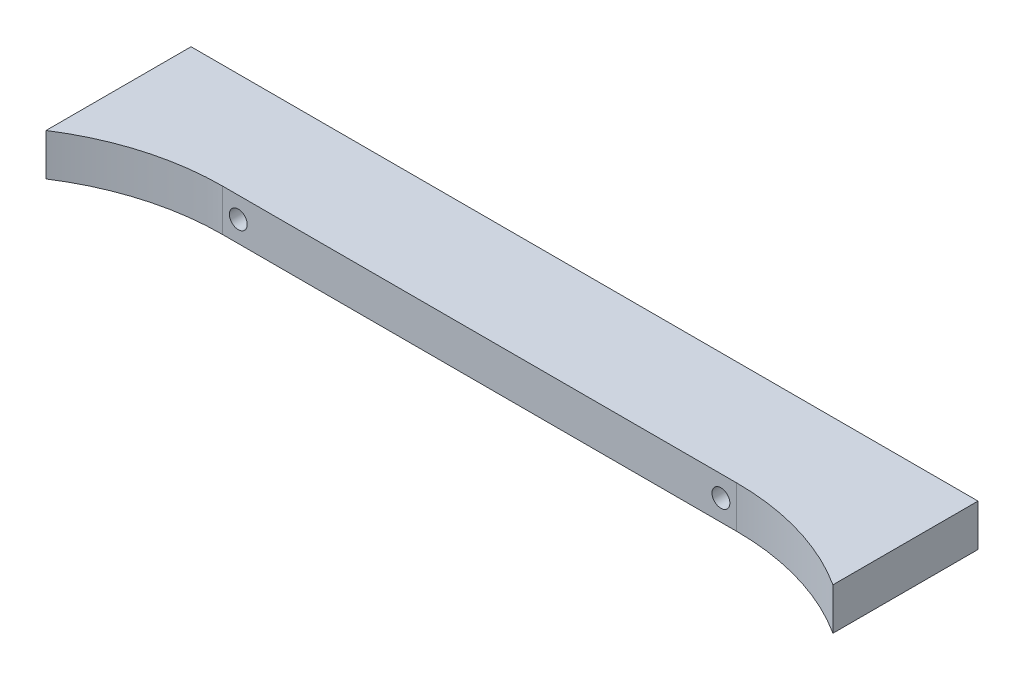
ISO-10303-21;
HEADER;
FILE_DESCRIPTION(('STEP AP214'),'2;1');
FILE_NAME('part.step','',(''),(''),'','','');
FILE_SCHEMA(('AUTOMOTIVE_DESIGN { 1 0 10303 214 1 1 1 1 }'));
ENDSEC;
DATA;
#1=APPLICATION_CONTEXT('core data for automotive mechanical design processes');
#2=APPLICATION_PROTOCOL_DEFINITION('international standard','automotive_design',2000,#1);
#3=PRODUCT_CONTEXT('',#1,'mechanical');
#4=PRODUCT('Part','Part','',(#3));
#5=PRODUCT_RELATED_PRODUCT_CATEGORY('part','',(#4));
#6=PRODUCT_DEFINITION_FORMATION('','',#4);
#7=PRODUCT_DEFINITION_CONTEXT('part definition',#1,'design');
#8=PRODUCT_DEFINITION('design','',#6,#7);
#9=PRODUCT_DEFINITION_SHAPE('','',#8);
#10=(LENGTH_UNIT() NAMED_UNIT(*) SI_UNIT(.MILLI.,.METRE.));
#11=(NAMED_UNIT(*) PLANE_ANGLE_UNIT() SI_UNIT($,.RADIAN.));
#12=(NAMED_UNIT(*) SI_UNIT($,.STERADIAN.) SOLID_ANGLE_UNIT());
#13=UNCERTAINTY_MEASURE_WITH_UNIT(LENGTH_MEASURE(1.E-05),#10,'distance_accuracy_value','');
#14=(GEOMETRIC_REPRESENTATION_CONTEXT(3) GLOBAL_UNCERTAINTY_ASSIGNED_CONTEXT((#13)) GLOBAL_UNIT_ASSIGNED_CONTEXT((#10,
#11,#12)) REPRESENTATION_CONTEXT('',''));
#15=CARTESIAN_POINT('',(0.,0.,0.));
#16=DIRECTION('',(0.,0.,1.));
#17=DIRECTION('',(1.,0.,0.));
#18=AXIS2_PLACEMENT_3D('',#15,#16,#17);
#19=CARTESIAN_POINT('',(0.,8.,10.));
#20=DIRECTION('',(0.,0.,-1.));
#21=DIRECTION('',(-1.,0.,0.));
#22=AXIS2_PLACEMENT_3D('',#19,#20,#21);
#23=PLANE('',#22);
#24=CARTESIAN_POINT('',(46.,4.,10.));
#25=DIRECTION('',(0.,0.,-1.));
#26=DIRECTION('',(-1.,0.,0.));
#27=AXIS2_PLACEMENT_3D('',#24,#25,#26);
#28=CIRCLE('',#27,1.7);
#29=CARTESIAN_POINT('',(44.3,4.,10.));
#30=VERTEX_POINT('',#29);
#31=EDGE_CURVE('E44',#30,#30,#28,.T.);
#32=ORIENTED_EDGE('',*,*,#31,.T.);
#33=EDGE_LOOP('',(#32));
#34=FACE_BOUND('',#33,.T.);
#35=CARTESIAN_POINT('',(-46.,4.,10.));
#36=DIRECTION('',(0.,0.,-1.));
#37=DIRECTION('',(-1.,0.,0.));
#38=AXIS2_PLACEMENT_3D('',#35,#36,#37);
#39=CIRCLE('',#38,1.7);
#40=CARTESIAN_POINT('',(-47.7,4.,10.));
#41=VERTEX_POINT('',#40);
#42=EDGE_CURVE('E130',#41,#41,#39,.T.);
#43=ORIENTED_EDGE('',*,*,#42,.T.);
#44=EDGE_LOOP('',(#43));
#45=FACE_BOUND('',#44,.T.);
#46=DIRECTION('',(1.,0.,0.));
#47=VECTOR('',#46,1.);
#48=CARTESIAN_POINT('',(0.,0.,10.));
#49=LINE('',#48,#47);
#50=CARTESIAN_POINT('',(-49.,0.,10.));
#51=VERTEX_POINT('',#50);
#52=CARTESIAN_POINT('',(49.,0.,10.));
#53=VERTEX_POINT('',#52);
#54=EDGE_CURVE('E127',#51,#53,#49,.T.);
#55=ORIENTED_EDGE('',*,*,#54,.T.);
#56=DIRECTION('',(0.,-1.,0.));
#57=VECTOR('',#56,1.);
#58=CARTESIAN_POINT('',(49.,8.,10.));
#59=LINE('',#58,#57);
#60=CARTESIAN_POINT('',(49.,8.,10.));
#61=VERTEX_POINT('',#60);
#62=EDGE_CURVE('E11',#61,#53,#59,.T.);
#63=ORIENTED_EDGE('',*,*,#62,.F.);
#64=DIRECTION('',(1.,0.,0.));
#65=VECTOR('',#64,1.);
#66=CARTESIAN_POINT('',(0.,8.,10.));
#67=LINE('',#66,#65);
#68=CARTESIAN_POINT('',(-49.,8.,10.));
#69=VERTEX_POINT('',#68);
#70=EDGE_CURVE('E141',#69,#61,#67,.T.);
#71=ORIENTED_EDGE('',*,*,#70,.F.);
#72=DIRECTION('',(0.,-1.,0.));
#73=VECTOR('',#72,1.);
#74=CARTESIAN_POINT('',(-49.,8.,10.));
#75=LINE('',#74,#73);
#76=EDGE_CURVE('E59',#69,#51,#75,.T.);
#77=ORIENTED_EDGE('',*,*,#76,.T.);
#78=EDGE_LOOP('',(#55,#63,#71,#77));
#79=FACE_BOUND('',#78,.T.);
#80=ADVANCED_FACE('F41',(#34,#45,#79),#23,.F.);
#81=CARTESIAN_POINT('',(49.,8.,58.));
#82=DIRECTION('',(0.,-1.,0.));
#83=DIRECTION('',(0.,0.,-1.));
#84=AXIS2_PLACEMENT_3D('',#81,#82,#83);
#85=CYLINDRICAL_SURFACE('',#84,48.);
#86=CARTESIAN_POINT('',(49.,0.,58.));
#87=DIRECTION('',(0.,1.,0.));
#88=DIRECTION('',(0.,0.,1.));
#89=AXIS2_PLACEMENT_3D('',#86,#87,#88);
#90=CIRCLE('',#89,48.);
#91=CARTESIAN_POINT('',(75.,0.,17.651517996336));
#92=VERTEX_POINT('',#91);
#93=EDGE_CURVE('E129',#53,#92,#90,.F.);
#94=ORIENTED_EDGE('',*,*,#93,.T.);
#95=DIRECTION('',(0.,-1.,0.));
#96=VECTOR('',#95,1.);
#97=CARTESIAN_POINT('',(75.,8.,17.651517996336));
#98=LINE('',#97,#96);
#99=CARTESIAN_POINT('',(75.,8.,17.651517996336));
#100=VERTEX_POINT('',#99);
#101=EDGE_CURVE('E50',#100,#92,#98,.T.);
#102=ORIENTED_EDGE('',*,*,#101,.F.);
#103=CARTESIAN_POINT('',(49.,8.,58.));
#104=DIRECTION('',(0.,1.,0.));
#105=DIRECTION('',(0.,0.,1.));
#106=AXIS2_PLACEMENT_3D('',#103,#104,#105);
#107=CIRCLE('',#106,48.);
#108=EDGE_CURVE('E91',#61,#100,#107,.F.);
#109=ORIENTED_EDGE('',*,*,#108,.F.);
#110=ORIENTED_EDGE('',*,*,#62,.T.);
#111=EDGE_LOOP('',(#94,#102,#109,#110));
#112=FACE_BOUND('',#111,.T.);
#113=ADVANCED_FACE('F162',(#112),#85,.F.);
#114=CARTESIAN_POINT('',(75.,8.,0.));
#115=DIRECTION('',(-1.,0.,0.));
#116=DIRECTION('',(0.,0.,1.));
#117=AXIS2_PLACEMENT_3D('',#114,#115,#116);
#118=PLANE('',#117);
#119=DIRECTION('',(0.,0.,-1.));
#120=VECTOR('',#119,1.);
#121=CARTESIAN_POINT('',(75.,0.,0.));
#122=LINE('',#121,#120);
#123=CARTESIAN_POINT('',(75.,0.,-10.));
#124=VERTEX_POINT('',#123);
#125=EDGE_CURVE('E132',#92,#124,#122,.T.);
#126=ORIENTED_EDGE('',*,*,#125,.T.);
#127=DIRECTION('',(0.,-1.,0.));
#128=VECTOR('',#127,1.);
#129=CARTESIAN_POINT('',(75.,8.,-10.));
#130=LINE('',#129,#128);
#131=CARTESIAN_POINT('',(75.,8.,-10.));
#132=VERTEX_POINT('',#131);
#133=EDGE_CURVE('E110',#132,#124,#130,.T.);
#134=ORIENTED_EDGE('',*,*,#133,.F.);
#135=DIRECTION('',(0.,0.,-1.));
#136=VECTOR('',#135,1.);
#137=CARTESIAN_POINT('',(75.,8.,0.));
#138=LINE('',#137,#136);
#139=EDGE_CURVE('E118',#100,#132,#138,.T.);
#140=ORIENTED_EDGE('',*,*,#139,.F.);
#141=ORIENTED_EDGE('',*,*,#101,.T.);
#142=EDGE_LOOP('',(#126,#134,#140,#141));
#143=FACE_BOUND('',#142,.T.);
#144=ADVANCED_FACE('F165',(#143),#118,.F.);
#145=CARTESIAN_POINT('',(0.,8.,-10.));
#146=DIRECTION('',(0.,0.,-1.));
#147=DIRECTION('',(-1.,0.,0.));
#148=AXIS2_PLACEMENT_3D('',#145,#146,#147);
#149=PLANE('',#148);
#150=CARTESIAN_POINT('',(55.,4.,-10.));
#151=DIRECTION('',(0.,0.,-1.));
#152=DIRECTION('',(-1.,0.,0.));
#153=AXIS2_PLACEMENT_3D('',#150,#151,#152);
#154=CIRCLE('',#153,2.6);
#155=CARTESIAN_POINT('',(52.4,4.,-10.));
#156=VERTEX_POINT('',#155);
#157=EDGE_CURVE('E206',#156,#156,#154,.T.);
#158=ORIENTED_EDGE('',*,*,#157,.F.);
#159=EDGE_LOOP('',(#158));
#160=FACE_BOUND('',#159,.T.);
#161=CARTESIAN_POINT('',(-55.,4.00000000000002,-10.));
#162=DIRECTION('',(0.,0.,-1.));
#163=DIRECTION('',(-1.,0.,0.));
#164=AXIS2_PLACEMENT_3D('',#161,#162,#163);
#165=CIRCLE('',#164,2.6);
#166=CARTESIAN_POINT('',(-57.6,4.00000000000002,-10.));
#167=VERTEX_POINT('',#166);
#168=EDGE_CURVE('E200',#167,#167,#165,.T.);
#169=ORIENTED_EDGE('',*,*,#168,.F.);
#170=EDGE_LOOP('',(#169));
#171=FACE_BOUND('',#170,.T.);
#172=CARTESIAN_POINT('',(46.,4.,-10.));
#173=DIRECTION('',(0.,0.,-1.));
#174=DIRECTION('',(-1.,0.,0.));
#175=AXIS2_PLACEMENT_3D('',#172,#173,#174);
#176=CIRCLE('',#175,3.25);
#177=CARTESIAN_POINT('',(42.75,4.,-10.));
#178=VERTEX_POINT('',#177);
#179=EDGE_CURVE('E194',#178,#178,#176,.T.);
#180=ORIENTED_EDGE('',*,*,#179,.F.);
#181=EDGE_LOOP('',(#180));
#182=FACE_BOUND('',#181,.T.);
#183=CARTESIAN_POINT('',(-46.,4.,-10.));
#184=DIRECTION('',(0.,0.,-1.));
#185=DIRECTION('',(-1.,0.,0.));
#186=AXIS2_PLACEMENT_3D('',#183,#184,#185);
#187=CIRCLE('',#186,3.25);
#188=CARTESIAN_POINT('',(-49.25,4.,-10.));
#189=VERTEX_POINT('',#188);
#190=EDGE_CURVE('E156',#189,#189,#187,.T.);
#191=ORIENTED_EDGE('',*,*,#190,.F.);
#192=EDGE_LOOP('',(#191));
#193=FACE_BOUND('',#192,.T.);
#194=DIRECTION('',(1.,0.,0.));
#195=VECTOR('',#194,1.);
#196=CARTESIAN_POINT('',(0.,0.,-10.));
#197=LINE('',#196,#195);
#198=CARTESIAN_POINT('',(-75.,0.,-10.));
#199=VERTEX_POINT('',#198);
#200=EDGE_CURVE('E106',#199,#124,#197,.T.);
#201=ORIENTED_EDGE('',*,*,#200,.F.);
#202=DIRECTION('',(0.,-1.,0.));
#203=VECTOR('',#202,1.);
#204=CARTESIAN_POINT('',(-75.,8.,-10.));
#205=LINE('',#204,#203);
#206=CARTESIAN_POINT('',(-75.,8.,-10.));
#207=VERTEX_POINT('',#206);
#208=EDGE_CURVE('E101',#207,#199,#205,.T.);
#209=ORIENTED_EDGE('',*,*,#208,.F.);
#210=DIRECTION('',(1.,0.,0.));
#211=VECTOR('',#210,1.);
#212=CARTESIAN_POINT('',(0.,8.,-10.));
#213=LINE('',#212,#211);
#214=EDGE_CURVE('E104',#207,#132,#213,.T.);
#215=ORIENTED_EDGE('',*,*,#214,.T.);
#216=ORIENTED_EDGE('',*,*,#133,.T.);
#217=EDGE_LOOP('',(#201,#209,#215,#216));
#218=FACE_BOUND('',#217,.T.);
#219=ADVANCED_FACE('F103',(#160,#171,#182,#193,#218),#149,.T.);
#220=CARTESIAN_POINT('',(-75.,8.,0.));
#221=DIRECTION('',(-1.,0.,0.));
#222=DIRECTION('',(0.,0.,1.));
#223=AXIS2_PLACEMENT_3D('',#220,#221,#222);
#224=PLANE('',#223);
#225=DIRECTION('',(0.,0.,-1.));
#226=VECTOR('',#225,1.);
#227=CARTESIAN_POINT('',(-75.,0.,0.));
#228=LINE('',#227,#226);
#229=CARTESIAN_POINT('',(-75.,0.,17.651517996336));
#230=VERTEX_POINT('',#229);
#231=EDGE_CURVE('E136',#230,#199,#228,.T.);
#232=ORIENTED_EDGE('',*,*,#231,.F.);
#233=DIRECTION('',(0.,-1.,0.));
#234=VECTOR('',#233,1.);
#235=CARTESIAN_POINT('',(-75.,8.,17.651517996336));
#236=LINE('',#235,#234);
#237=CARTESIAN_POINT('',(-75.,8.,17.651517996336));
#238=VERTEX_POINT('',#237);
#239=EDGE_CURVE('E79',#238,#230,#236,.T.);
#240=ORIENTED_EDGE('',*,*,#239,.F.);
#241=DIRECTION('',(0.,0.,-1.));
#242=VECTOR('',#241,1.);
#243=CARTESIAN_POINT('',(-75.,8.,0.));
#244=LINE('',#243,#242);
#245=EDGE_CURVE('E116',#238,#207,#244,.T.);
#246=ORIENTED_EDGE('',*,*,#245,.T.);
#247=ORIENTED_EDGE('',*,*,#208,.T.);
#248=EDGE_LOOP('',(#232,#240,#246,#247));
#249=FACE_BOUND('',#248,.T.);
#250=ADVANCED_FACE('F121',(#249),#224,.T.);
#251=CARTESIAN_POINT('',(-49.,8.,58.));
#252=DIRECTION('',(0.,-1.,0.));
#253=DIRECTION('',(0.,0.,-1.));
#254=AXIS2_PLACEMENT_3D('',#251,#252,#253);
#255=CYLINDRICAL_SURFACE('',#254,48.);
#256=CARTESIAN_POINT('',(-49.,0.,58.));
#257=DIRECTION('',(0.,1.,0.));
#258=DIRECTION('',(0.,0.,1.));
#259=AXIS2_PLACEMENT_3D('',#256,#257,#258);
#260=CIRCLE('',#259,48.);
#261=EDGE_CURVE('E138',#51,#230,#260,.T.);
#262=ORIENTED_EDGE('',*,*,#261,.F.);
#263=ORIENTED_EDGE('',*,*,#76,.F.);
#264=CARTESIAN_POINT('',(-49.,8.,58.));
#265=DIRECTION('',(0.,1.,0.));
#266=DIRECTION('',(0.,0.,1.));
#267=AXIS2_PLACEMENT_3D('',#264,#265,#266);
#268=CIRCLE('',#267,48.);
#269=EDGE_CURVE('E122',#69,#238,#268,.T.);
#270=ORIENTED_EDGE('',*,*,#269,.T.);
#271=ORIENTED_EDGE('',*,*,#239,.T.);
#272=EDGE_LOOP('',(#262,#263,#270,#271));
#273=FACE_BOUND('',#272,.T.);
#274=ADVANCED_FACE('F168',(#273),#255,.F.);
#275=CARTESIAN_POINT('',(0.,8.,0.));
#276=DIRECTION('',(0.,1.,0.));
#277=DIRECTION('',(0.,0.,1.));
#278=AXIS2_PLACEMENT_3D('',#275,#276,#277);
#279=PLANE('',#278);
#280=ORIENTED_EDGE('',*,*,#70,.T.);
#281=ORIENTED_EDGE('',*,*,#108,.T.);
#282=ORIENTED_EDGE('',*,*,#139,.T.);
#283=ORIENTED_EDGE('',*,*,#214,.F.);
#284=ORIENTED_EDGE('',*,*,#245,.F.);
#285=ORIENTED_EDGE('',*,*,#269,.F.);
#286=EDGE_LOOP('',(#280,#281,#282,#283,#284,#285));
#287=FACE_BOUND('',#286,.T.);
#288=ADVANCED_FACE('F114',(#287),#279,.T.);
#289=CARTESIAN_POINT('',(0.,0.,0.));
#290=DIRECTION('',(0.,1.,0.));
#291=DIRECTION('',(0.,0.,1.));
#292=AXIS2_PLACEMENT_3D('',#289,#290,#291);
#293=PLANE('',#292);
#294=ORIENTED_EDGE('',*,*,#54,.F.);
#295=ORIENTED_EDGE('',*,*,#261,.T.);
#296=ORIENTED_EDGE('',*,*,#231,.T.);
#297=ORIENTED_EDGE('',*,*,#200,.T.);
#298=ORIENTED_EDGE('',*,*,#125,.F.);
#299=ORIENTED_EDGE('',*,*,#93,.F.);
#300=EDGE_LOOP('',(#294,#295,#296,#297,#298,#299));
#301=FACE_BOUND('',#300,.T.);
#302=ADVANCED_FACE('F167',(#301),#293,.F.);
#303=CARTESIAN_POINT('',(-46.,4.,-10.));
#304=DIRECTION('',(0.,0.,-1.));
#305=DIRECTION('',(-1.,0.,0.));
#306=AXIS2_PLACEMENT_3D('',#303,#304,#305);
#307=CYLINDRICAL_SURFACE('',#306,1.7);
#308=CARTESIAN_POINT('',(-46.,4.,6.));
#309=DIRECTION('',(0.,0.,-1.));
#310=DIRECTION('',(-1.,0.,0.));
#311=AXIS2_PLACEMENT_3D('',#308,#309,#310);
#312=CIRCLE('',#311,1.7);
#313=CARTESIAN_POINT('',(-47.7,4.,6.));
#314=VERTEX_POINT('',#313);
#315=EDGE_CURVE('E147',#314,#314,#312,.T.);
#316=ORIENTED_EDGE('',*,*,#315,.T.);
#317=EDGE_LOOP('',(#316));
#318=FACE_BOUND('',#317,.T.);
#319=ORIENTED_EDGE('',*,*,#42,.F.);
#320=EDGE_LOOP('',(#319));
#321=FACE_BOUND('',#320,.T.);
#322=ADVANCED_FACE('F242',(#318,#321),#307,.F.);
#323=CARTESIAN_POINT('',(-44.3,4.,6.));
#324=DIRECTION('',(0.,0.,1.));
#325=DIRECTION('',(1.,0.,0.));
#326=AXIS2_PLACEMENT_3D('',#323,#324,#325);
#327=PLANE('',#326);
#328=ORIENTED_EDGE('',*,*,#315,.F.);
#329=EDGE_LOOP('',(#328));
#330=FACE_BOUND('',#329,.T.);
#331=CARTESIAN_POINT('',(-46.,4.,6.));
#332=DIRECTION('',(0.,0.,-1.));
#333=DIRECTION('',(-1.,0.,0.));
#334=AXIS2_PLACEMENT_3D('',#331,#332,#333);
#335=CIRCLE('',#334,3.25);
#336=CARTESIAN_POINT('',(-49.25,4.,6.));
#337=VERTEX_POINT('',#336);
#338=EDGE_CURVE('E151',#337,#337,#335,.T.);
#339=ORIENTED_EDGE('',*,*,#338,.T.);
#340=EDGE_LOOP('',(#339));
#341=FACE_BOUND('',#340,.T.);
#342=ADVANCED_FACE('F233',(#330,#341),#327,.F.);
#343=CARTESIAN_POINT('',(-46.,4.,-10.));
#344=DIRECTION('',(0.,0.,-1.));
#345=DIRECTION('',(-1.,0.,0.));
#346=AXIS2_PLACEMENT_3D('',#343,#344,#345);
#347=CYLINDRICAL_SURFACE('',#346,3.25);
#348=ORIENTED_EDGE('',*,*,#338,.F.);
#349=EDGE_LOOP('',(#348));
#350=FACE_BOUND('',#349,.T.);
#351=ORIENTED_EDGE('',*,*,#190,.T.);
#352=EDGE_LOOP('',(#351));
#353=FACE_BOUND('',#352,.T.);
#354=ADVANCED_FACE('F230',(#350,#353),#347,.F.);
#355=CARTESIAN_POINT('',(46.,4.,-10.));
#356=DIRECTION('',(0.,0.,-1.));
#357=DIRECTION('',(-1.,0.,0.));
#358=AXIS2_PLACEMENT_3D('',#355,#356,#357);
#359=CYLINDRICAL_SURFACE('',#358,1.7);
#360=CARTESIAN_POINT('',(46.,4.,6.));
#361=DIRECTION('',(0.,0.,-1.));
#362=DIRECTION('',(-1.,0.,0.));
#363=AXIS2_PLACEMENT_3D('',#360,#361,#362);
#364=CIRCLE('',#363,1.7);
#365=CARTESIAN_POINT('',(44.3,4.,6.));
#366=VERTEX_POINT('',#365);
#367=EDGE_CURVE('E186',#366,#366,#364,.T.);
#368=ORIENTED_EDGE('',*,*,#367,.T.);
#369=EDGE_LOOP('',(#368));
#370=FACE_BOUND('',#369,.T.);
#371=ORIENTED_EDGE('',*,*,#31,.F.);
#372=EDGE_LOOP('',(#371));
#373=FACE_BOUND('',#372,.T.);
#374=ADVANCED_FACE('F232',(#370,#373),#359,.F.);
#375=CARTESIAN_POINT('',(47.7,4.,6.));
#376=DIRECTION('',(0.,0.,1.));
#377=DIRECTION('',(1.,0.,0.));
#378=AXIS2_PLACEMENT_3D('',#375,#376,#377);
#379=PLANE('',#378);
#380=ORIENTED_EDGE('',*,*,#367,.F.);
#381=EDGE_LOOP('',(#380));
#382=FACE_BOUND('',#381,.T.);
#383=CARTESIAN_POINT('',(46.,4.,6.));
#384=DIRECTION('',(0.,0.,-1.));
#385=DIRECTION('',(-1.,0.,0.));
#386=AXIS2_PLACEMENT_3D('',#383,#384,#385);
#387=CIRCLE('',#386,3.25);
#388=CARTESIAN_POINT('',(42.75,4.,6.));
#389=VERTEX_POINT('',#388);
#390=EDGE_CURVE('E189',#389,#389,#387,.T.);
#391=ORIENTED_EDGE('',*,*,#390,.T.);
#392=EDGE_LOOP('',(#391));
#393=FACE_BOUND('',#392,.T.);
#394=ADVANCED_FACE('F240',(#382,#393),#379,.F.);
#395=CARTESIAN_POINT('',(46.,4.,-10.));
#396=DIRECTION('',(0.,0.,-1.));
#397=DIRECTION('',(-1.,0.,0.));
#398=AXIS2_PLACEMENT_3D('',#395,#396,#397);
#399=CYLINDRICAL_SURFACE('',#398,3.25);
#400=ORIENTED_EDGE('',*,*,#390,.F.);
#401=EDGE_LOOP('',(#400));
#402=FACE_BOUND('',#401,.T.);
#403=ORIENTED_EDGE('',*,*,#179,.T.);
#404=EDGE_LOOP('',(#403));
#405=FACE_BOUND('',#404,.T.);
#406=ADVANCED_FACE('F281',(#402,#405),#399,.F.);
#407=CARTESIAN_POINT('',(-55.,4.00000000000002,0.));
#408=DIRECTION('',(0.,0.,-1.));
#409=DIRECTION('',(-1.,0.,0.));
#410=AXIS2_PLACEMENT_3D('',#407,#408,#409);
#411=CYLINDRICAL_SURFACE('',#410,2.6);
#412=CARTESIAN_POINT('',(-55.,4.00000000000002,0.));
#413=DIRECTION('',(0.,0.,-1.));
#414=DIRECTION('',(-1.,0.,0.));
#415=AXIS2_PLACEMENT_3D('',#412,#413,#414);
#416=CIRCLE('',#415,2.6);
#417=CARTESIAN_POINT('',(-57.6,4.00000000000002,0.));
#418=VERTEX_POINT('',#417);
#419=EDGE_CURVE('E203',#418,#418,#416,.T.);
#420=ORIENTED_EDGE('',*,*,#419,.F.);
#421=EDGE_LOOP('',(#420));
#422=FACE_BOUND('',#421,.T.);
#423=ORIENTED_EDGE('',*,*,#168,.T.);
#424=EDGE_LOOP('',(#423));
#425=FACE_BOUND('',#424,.T.);
#426=ADVANCED_FACE('F290',(#422,#425),#411,.F.);
#427=CARTESIAN_POINT('',(-55.,4.00000000000002,0.));
#428=DIRECTION('',(0.,0.,-1.));
#429=DIRECTION('',(-1.,0.,0.));
#430=AXIS2_PLACEMENT_3D('',#427,#428,#429);
#431=PLANE('',#430);
#432=ORIENTED_EDGE('',*,*,#419,.T.);
#433=EDGE_LOOP('',(#432));
#434=FACE_BOUND('',#433,.T.);
#435=ADVANCED_FACE('F217',(#434),#431,.T.);
#436=CARTESIAN_POINT('',(55.,4.,0.));
#437=DIRECTION('',(0.,0.,-1.));
#438=DIRECTION('',(-1.,0.,0.));
#439=AXIS2_PLACEMENT_3D('',#436,#437,#438);
#440=CYLINDRICAL_SURFACE('',#439,2.6);
#441=CARTESIAN_POINT('',(55.,4.,0.));
#442=DIRECTION('',(0.,0.,-1.));
#443=DIRECTION('',(-1.,0.,0.));
#444=AXIS2_PLACEMENT_3D('',#441,#442,#443);
#445=CIRCLE('',#444,2.6);
#446=CARTESIAN_POINT('',(52.4,4.,0.));
#447=VERTEX_POINT('',#446);
#448=EDGE_CURVE('E199',#447,#447,#445,.T.);
#449=ORIENTED_EDGE('',*,*,#448,.F.);
#450=EDGE_LOOP('',(#449));
#451=FACE_BOUND('',#450,.T.);
#452=ORIENTED_EDGE('',*,*,#157,.T.);
#453=EDGE_LOOP('',(#452));
#454=FACE_BOUND('',#453,.T.);
#455=ADVANCED_FACE('F214',(#451,#454),#440,.F.);
#456=CARTESIAN_POINT('',(55.,4.,0.));
#457=DIRECTION('',(0.,0.,-1.));
#458=DIRECTION('',(-1.,0.,0.));
#459=AXIS2_PLACEMENT_3D('',#456,#457,#458);
#460=PLANE('',#459);
#461=ORIENTED_EDGE('',*,*,#448,.T.);
#462=EDGE_LOOP('',(#461));
#463=FACE_BOUND('',#462,.T.);
#464=ADVANCED_FACE('F212',(#463),#460,.T.);
#465=CLOSED_SHELL('',(#80,#113,#144,#219,#250,#274,#288,#302,#322,#342,#354,#374,#394,#406,#426,
#435,#455,#464));
#466=MANIFOLD_SOLID_BREP('B2',#465);
#467=ADVANCED_BREP_SHAPE_REPRESENTATION('',(#18,#466),#14);
#468=SHAPE_DEFINITION_REPRESENTATION(#9,#467);
ENDSEC;
END-ISO-10303-21;
